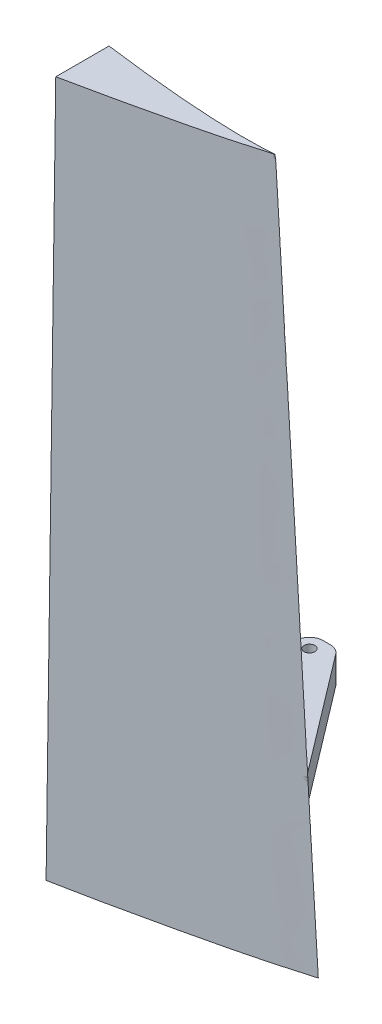
ISO-10303-21;
HEADER;
FILE_DESCRIPTION(('STEP AP214'),'2;1');
FILE_NAME('part.step','',(''),(''),'','','');
FILE_SCHEMA(('AUTOMOTIVE_DESIGN { 1 0 10303 214 1 1 1 1 }'));
ENDSEC;
DATA;
#1=APPLICATION_CONTEXT('core data for automotive mechanical design processes');
#2=APPLICATION_PROTOCOL_DEFINITION('international standard','automotive_design',2000,#1);
#3=PRODUCT_CONTEXT('',#1,'mechanical');
#4=PRODUCT('Part','Part','',(#3));
#5=PRODUCT_RELATED_PRODUCT_CATEGORY('part','',(#4));
#6=PRODUCT_DEFINITION_FORMATION('','',#4);
#7=PRODUCT_DEFINITION_CONTEXT('part definition',#1,'design');
#8=PRODUCT_DEFINITION('design','',#6,#7);
#9=PRODUCT_DEFINITION_SHAPE('','',#8);
#10=(LENGTH_UNIT() NAMED_UNIT(*) SI_UNIT(.MILLI.,.METRE.));
#11=(NAMED_UNIT(*) PLANE_ANGLE_UNIT() SI_UNIT($,.RADIAN.));
#12=(NAMED_UNIT(*) SI_UNIT($,.STERADIAN.) SOLID_ANGLE_UNIT());
#13=UNCERTAINTY_MEASURE_WITH_UNIT(LENGTH_MEASURE(1.E-05),#10,'distance_accuracy_value','');
#14=(GEOMETRIC_REPRESENTATION_CONTEXT(3) GLOBAL_UNCERTAINTY_ASSIGNED_CONTEXT((#13)) GLOBAL_UNIT_ASSIGNED_CONTEXT((#10,
#11,#12)) REPRESENTATION_CONTEXT('',''));
#15=CARTESIAN_POINT('',(0.,0.,0.));
#16=DIRECTION('',(0.,0.,1.));
#17=DIRECTION('',(1.,0.,0.));
#18=AXIS2_PLACEMENT_3D('',#15,#16,#17);
#19=CARTESIAN_POINT('',(0.,0.,-9.74075468761381));
#20=CARTESIAN_POINT('',(0.,100.,-9.10882338308395));
#21=CARTESIAN_POINT('',(6.0061327946258,0.,-8.91211822307364));
#22=CARTESIAN_POINT('',(4.83074507039604,100.,-8.48507393399278));
#23=CARTESIAN_POINT('',(13.4925178354512,0.,-7.96436008493839));
#24=CARTESIAN_POINT('',(10.8562340202713,99.9999999999999,-7.8023381409646));
#25=CARTESIAN_POINT('',(22.7343715259555,0.,-7.36164463409852));
#26=CARTESIAN_POINT('',(18.2837087437012,100.,-7.42026106854466));
#27=CARTESIAN_POINT('',(26.1484299527672,0.,-7.27193279379961));
#28=CARTESIAN_POINT('',(21.0283614825598,100.,-7.36259403798258));
#29=CARTESIAN_POINT('',(28.7053996672856,0.,-7.28866482606949));
#30=CARTESIAN_POINT('',(23.0823413646609,100.,-7.40087076527242));
#31=CARTESIAN_POINT('',(29.820959368834,0.,-7.31240387331745));
#32=CARTESIAN_POINT('',(23.9780975933803,100.,-7.43220381420277));
#33=CARTESIAN_POINT('',(30.7154561438188,0.,-7.36119318811639));
#34=CARTESIAN_POINT('',(24.6969922007095,100.,-7.46804709782093));
#35=CARTESIAN_POINT('',(31.0472754487582,0.,-7.37694125723781));
#36=CARTESIAN_POINT('',(24.9634580372859,100.,-7.48246091052375));
#37=CARTESIAN_POINT('',(31.1034867424999,0.,-7.37952788405883));
#38=CARTESIAN_POINT('',(25.0085685081877,100.,-7.48525379677008));
#39=CARTESIAN_POINT('',(31.3924160200126,0.,-7.39219815360227));
#40=CARTESIAN_POINT('',(25.240271714091,100.,-7.50132344338924));
#41=CARTESIAN_POINT('',(31.6228956510798,0.,-7.42006883497855));
#42=CARTESIAN_POINT('',(25.4264556624199,100.,-7.51998820533948));
#43=CARTESIAN_POINT('',(31.8753586265432,0.,-7.44723586825525));
#44=CARTESIAN_POINT('',(25.6232251348601,100.,-7.54451848316814));
#45=CARTESIAN_POINT('',(31.8915028454835,0.,-7.4489607280713));
#46=CARTESIAN_POINT('',(25.6425016889953,99.9999999999999,-7.54598208356528));
#47=CARTESIAN_POINT('',(31.9076853144743,0.,-7.45066994004273));
#48=CARTESIAN_POINT('',(25.6487450561573,100.,-7.54433163558381));
#49=CARTESIAN_POINT('',(31.9205102381514,0.,-7.45196702689124));
#50=CARTESIAN_POINT('',(25.6522646762437,100.,-7.54267559031721));
#51=CARTESIAN_POINT('',(31.9306592861827,0.,-7.45270429987545));
#52=CARTESIAN_POINT('',(25.6338782102697,100.,-7.53783962001277));
#53=CARTESIAN_POINT('',(31.9356214851594,0.,-7.45083311328495));
#54=CARTESIAN_POINT('',(25.62475437363,100.,-7.53598201101249));
#55=CARTESIAN_POINT('',(31.9359350866917,0.,-7.45068947570391));
#56=CARTESIAN_POINT('',(25.6241212292483,100.,-7.53585301240149));
#57=CARTESIAN_POINT('',(31.939430656982,0.,-7.44871947015887));
#58=CARTESIAN_POINT('',(25.6162419234391,100.,-7.53424653427601));
#59=CARTESIAN_POINT('',(31.9198546951872,0.,-7.44398246280323));
#60=CARTESIAN_POINT('',(25.6089983384478,100.,-7.53275781562939));
#61=CARTESIAN_POINT('',(31.6839387203871,0.,-7.39548664764486));
#62=CARTESIAN_POINT('',(25.4195218354743,100.,-7.49351391043845));
#63=CARTESIAN_POINT('',(31.4577328945988,0.,-7.34471355371303));
#64=CARTESIAN_POINT('',(25.2388903082908,100.,-7.44878342153052));
#65=CARTESIAN_POINT('',(31.2066353568834,0.,-7.27190684790176));
#66=CARTESIAN_POINT('',(25.0357141849858,100.,-7.39573470974058));
#67=CARTESIAN_POINT('',(30.3922993052073,0.,-7.0361349077299));
#68=CARTESIAN_POINT('',(24.3771398067983,100.,-7.22263958139223));
#69=CARTESIAN_POINT('',(29.5756562209111,0.,-6.80867925336944));
#70=CARTESIAN_POINT('',(23.7246463739093,100.,-7.02712253926371));
#71=CARTESIAN_POINT('',(28.6237362484546,0.,-6.52497274375956));
#72=CARTESIAN_POINT('',(22.9596749106355,100.,-6.79951717712916));
#73=CARTESIAN_POINT('',(26.0530539749238,0.,-5.76737991113132));
#74=CARTESIAN_POINT('',(20.8953524951071,99.9999999999998,-6.18624357400259));
#75=CARTESIAN_POINT('',(23.4505403594325,0.,-5.1243831208334));
#76=CARTESIAN_POINT('',(18.8130262924454,99.9999999999998,-5.63684193570972));
#77=CARTESIAN_POINT('',(20.832639059026,0.,-4.50201744049619));
#78=CARTESIAN_POINT('',(16.7115240068306,99.9999999999999,-5.13201881249129));
#79=CARTESIAN_POINT('',(16.3358571443051,0.,-3.43608040628613));
#80=CARTESIAN_POINT('',(13.1019899601075,99.9999999999999,-4.26628313216813));
#81=CARTESIAN_POINT('',(9.34362759695032,0.,-1.86555982861522));
#82=CARTESIAN_POINT('',(7.49088806589531,100.,-2.97315351682197));
#83=CARTESIAN_POINT('',(2.50228088319128,0.,-0.471593962152759));
#84=CARTESIAN_POINT('',(2.00418778404205,100.,-1.80976282935904));
#85=CARTESIAN_POINT('',(0.,0.,0.));
#86=CARTESIAN_POINT('',(0.,100.,-1.4));
#87=B_SPLINE_SURFACE_WITH_KNOTS('',3,1,((#19,#20),(#21,#22),(#23,#24),(#25,#26),(#27,#28),(#29,
#30),(#31,#32),(#33,#34),(#35,#36),(#37,#38),(#39,#40),(#41,#42),(#43,#44),(#45,#46),(#47,#48),
(#49,#50),(#51,#52),(#53,#54),(#55,#56),(#57,#58),(#59,#60),(#61,#62),(#63,#64),(#65,#66),(#67,
#68),(#69,#70),(#71,#72),(#73,#74),(#75,#76),(#77,#78),(#79,#80),(#81,#82),(#83,#84),(#85,#86)),
.UNSPECIFIED.,.F.,.F.,.F.,(4,1,1,1,1,1,2,2,2,1,2,2,2,2,2,1,2,1,2,1,1,4),(2,2),(0.,
0.280352533806822,0.34869858818309,0.428120218321933,0.438280244880666,0.466950155301034,
0.479707552212127,0.482309106800574,0.493077559149514,0.493720167324993,0.49380584417098,
0.494304555707245,0.494341745496035,0.49476738677823,0.505479493763305,0.506855620546668,
0.544678614705215,0.552784092814143,0.668603311183267,0.677186907922647,0.88225829703551,1.),
(0.,1.),.UNSPECIFIED.);
#88=CARTESIAN_POINT('',(0.,0.,0.));
#89=CARTESIAN_POINT('',(2.50228088319128,0.,-0.471593962152759));
#90=CARTESIAN_POINT('',(9.34362759695032,0.,-1.86555982861522));
#91=CARTESIAN_POINT('',(16.3358571443051,0.,-3.43608040628613));
#92=CARTESIAN_POINT('',(20.832639059026,0.,-4.50201744049619));
#93=CARTESIAN_POINT('',(23.4505403594325,0.,-5.1243831208334));
#94=CARTESIAN_POINT('',(26.0530539749238,0.,-5.76737991113132));
#95=CARTESIAN_POINT('',(28.6237362484546,0.,-6.52497274375956));
#96=CARTESIAN_POINT('',(29.5756562209111,0.,-6.80867925336944));
#97=CARTESIAN_POINT('',(30.3922993052073,0.,-7.0361349077299));
#98=CARTESIAN_POINT('',(31.2066353568834,0.,-7.27190684790176));
#99=CARTESIAN_POINT('',(31.4577328945988,0.,-7.34471355371303));
#100=CARTESIAN_POINT('',(31.6839387203871,0.,-7.39548664764486));
#101=CARTESIAN_POINT('',(31.9198546951872,0.,-7.44398246280323));
#102=CARTESIAN_POINT('',(31.939430656982,0.,-7.44871947015887));
#103=CARTESIAN_POINT('',(31.9359350866917,0.,-7.45068947570391));
#104=CARTESIAN_POINT('',(31.9356214851594,0.,-7.45083311328495));
#105=CARTESIAN_POINT('',(31.9306592861827,0.,-7.45270429987545));
#106=CARTESIAN_POINT('',(31.9205102381514,0.,-7.45196702689124));
#107=CARTESIAN_POINT('',(31.9076853144743,0.,-7.45066994004273));
#108=CARTESIAN_POINT('',(31.8915028454835,0.,-7.4489607280713));
#109=CARTESIAN_POINT('',(31.8753586265432,0.,-7.44723586825525));
#110=CARTESIAN_POINT('',(31.6228956510798,0.,-7.42006883497855));
#111=CARTESIAN_POINT('',(31.3924160200126,0.,-7.39219815360227));
#112=CARTESIAN_POINT('',(31.1034867424999,0.,-7.37952788405883));
#113=CARTESIAN_POINT('',(31.0472754487582,0.,-7.37694125723781));
#114=CARTESIAN_POINT('',(30.7154561438188,0.,-7.36119318811639));
#115=CARTESIAN_POINT('',(29.820959368834,0.,-7.31240387331745));
#116=CARTESIAN_POINT('',(28.7053996672856,0.,-7.28866482606949));
#117=CARTESIAN_POINT('',(26.1484299527672,0.,-7.27193279379961));
#118=CARTESIAN_POINT('',(22.7343715259555,0.,-7.36164463409852));
#119=CARTESIAN_POINT('',(13.4925178354512,0.,-7.96436008493839));
#120=CARTESIAN_POINT('',(6.0061327946258,0.,-8.91211822307364));
#121=CARTESIAN_POINT('',(0.,0.,-9.74075468761381));
#122=B_SPLINE_CURVE_WITH_KNOTS('',3,(#88,#89,#90,#91,#92,#93,#94,#95,#96,#97,#98,#99,#100,#101,
#102,#103,#104,#105,#106,#107,#108,#109,#110,#111,#112,#113,#114,#115,#116,#117,#118,#119,#120,
#121),.UNSPECIFIED.,.F.,.F.,(4,1,1,2,1,2,1,2,2,2,2,2,1,2,2,2,1,1,1,1,1,4),(0.,0.11774170296449,
0.322813092077353,0.331396688816733,0.447215907185857,0.455321385294785,0.493144379453332,
0.494520506236695,0.50523261322177,0.505658254503965,0.505695444292755,0.50619415582902,
0.506279832675007,0.506922440850486,0.517690893199426,0.520292447787873,0.533049844698966,
0.561719755119334,0.571879781678067,0.65130141181691,0.719647466193178,1.),.UNSPECIFIED.);
#123=CARTESIAN_POINT('',(0.,0.,-9.74075468761382));
#124=VERTEX_POINT('',#123);
#125=CARTESIAN_POINT('',(0.,0.,0.));
#126=VERTEX_POINT('',#125);
#127=EDGE_CURVE('E148',#124,#126,#122,.F.);
#128=CARTESIAN_POINT('',(0.,0.,-9.74075468761381));
#129=CARTESIAN_POINT('',(0.,100.,-9.10882338308395));
#130=B_SPLINE_CURVE_WITH_KNOTS('',1,(#128,#129),.UNSPECIFIED.,.F.,.F.,(2,2),(0.,1.),.UNSPECIFIED.);
#131=CARTESIAN_POINT('',(0.,100.,-9.10882338308395));
#132=VERTEX_POINT('',#131);
#133=EDGE_CURVE('E268',#124,#132,#130,.T.);
#134=CARTESIAN_POINT('',(0.,100.,-9.10882338308395));
#135=CARTESIAN_POINT('',(4.83074507039604,100.,-8.48507393399278));
#136=CARTESIAN_POINT('',(10.8562340202713,99.9999999999999,-7.8023381409646));
#137=CARTESIAN_POINT('',(18.2837087437012,100.,-7.42026106854466));
#138=CARTESIAN_POINT('',(21.0283614825598,100.,-7.36259403798258));
#139=CARTESIAN_POINT('',(23.0823413646609,100.,-7.40087076527242));
#140=CARTESIAN_POINT('',(23.9780975933803,100.,-7.43220381420277));
#141=CARTESIAN_POINT('',(24.6969922007095,100.,-7.46804709782093));
#142=CARTESIAN_POINT('',(24.9634580372859,100.,-7.48246091052375));
#143=CARTESIAN_POINT('',(25.0085685081877,100.,-7.48525379677008));
#144=CARTESIAN_POINT('',(25.240271714091,100.,-7.50132344338924));
#145=CARTESIAN_POINT('',(25.4264556624199,100.,-7.51998820533948));
#146=CARTESIAN_POINT('',(25.6232251348601,100.,-7.54451848316814));
#147=CARTESIAN_POINT('',(25.6425016889953,99.9999999999999,-7.54598208356528));
#148=CARTESIAN_POINT('',(25.6487450561573,100.,-7.54433163558381));
#149=CARTESIAN_POINT('',(25.6522646762437,100.,-7.54267559031721));
#150=CARTESIAN_POINT('',(25.6338782102697,100.,-7.53783962001277));
#151=CARTESIAN_POINT('',(25.62475437363,100.,-7.53598201101249));
#152=CARTESIAN_POINT('',(25.6241212292483,100.,-7.53585301240149));
#153=CARTESIAN_POINT('',(25.6162419234391,100.,-7.53424653427601));
#154=CARTESIAN_POINT('',(25.6089983384478,100.,-7.53275781562939));
#155=CARTESIAN_POINT('',(25.4195218354743,100.,-7.49351391043845));
#156=CARTESIAN_POINT('',(25.2388903082908,100.,-7.44878342153052));
#157=CARTESIAN_POINT('',(25.0357141849858,100.,-7.39573470974058));
#158=CARTESIAN_POINT('',(24.3771398067983,100.,-7.22263958139223));
#159=CARTESIAN_POINT('',(23.7246463739093,100.,-7.02712253926371));
#160=CARTESIAN_POINT('',(22.9596749106355,100.,-6.79951717712916));
#161=CARTESIAN_POINT('',(20.8953524951071,99.9999999999998,-6.18624357400259));
#162=CARTESIAN_POINT('',(18.8130262924454,99.9999999999998,-5.63684193570972));
#163=CARTESIAN_POINT('',(16.7115240068306,99.9999999999999,-5.13201881249129));
#164=CARTESIAN_POINT('',(13.1019899601075,99.9999999999999,-4.26628313216813));
#165=CARTESIAN_POINT('',(7.49088806589531,100.,-2.97315351682197));
#166=CARTESIAN_POINT('',(2.00418778404205,100.,-1.80976282935904));
#167=CARTESIAN_POINT('',(0.,100.,-1.4));
#168=B_SPLINE_CURVE_WITH_KNOTS('',3,(#134,#135,#136,#137,#138,#139,#140,#141,#142,#143,#144,
#145,#146,#147,#148,#149,#150,#151,#152,#153,#154,#155,#156,#157,#158,#159,#160,#161,#162,#163,
#164,#165,#166,#167),.UNSPECIFIED.,.F.,.F.,(4,1,1,1,1,1,2,2,2,1,2,2,2,2,2,1,2,1,2,1,1,4),(0.,
0.280352533806822,0.34869858818309,0.428120218321933,0.438280244880666,0.466950155301034,
0.479707552212127,0.482309106800574,0.493077559149514,0.493720167324993,0.49380584417098,
0.494304555707245,0.494341745496035,0.49476738677823,0.505479493763305,0.506855620546668,
0.544678614705215,0.552784092814143,0.668603311183267,0.677186907922647,0.88225829703551,1.),.UNSPECIFIED.);
#169=CARTESIAN_POINT('',(0.,100.,-1.4));
#170=VERTEX_POINT('',#169);
#171=EDGE_CURVE('E152',#170,#132,#168,.F.);
#172=CARTESIAN_POINT('',(0.,100.,-1.4));
#173=CARTESIAN_POINT('',(0.,0.,0.));
#174=B_SPLINE_CURVE_WITH_KNOTS('',1,(#172,#173),.UNSPECIFIED.,.F.,.F.,(2,2),(0.,1.),.UNSPECIFIED.);
#175=EDGE_CURVE('E283',#126,#170,#174,.F.);
#176=CARTESIAN_POINT('',(27.6577912531365,6.,-7.29053907199752));
#177=CARTESIAN_POINT('',(26.88755452627,6.,-7.28490868604674));
#178=CARTESIAN_POINT('',(26.1173154660965,6.,-7.28976908745462));
#179=CARTESIAN_POINT('',(24.5775002676797,6.,-7.3176622509968));
#180=CARTESIAN_POINT('',(23.8079239870242,6.,-7.34068687988562));
#181=CARTESIAN_POINT('',(22.26948033135,6.,-7.40209653629572));
#182=CARTESIAN_POINT('',(21.5006128994215,6.,-7.44048019889503));
#183=CARTESIAN_POINT('',(19.964402855378,6.,-7.52996945690902));
#184=CARTESIAN_POINT('',(19.1970594873694,6.,-7.5810622442991));
#185=CARTESIAN_POINT('',(18.0465760351733,6.,-7.66536187728852));
#186=CARTESIAN_POINT('',(17.6631483228459,6.,-7.69474038884396));
#187=CARTESIAN_POINT('',(16.8964784944677,6.,-7.75582860834423));
#188=CARTESIAN_POINT('',(16.5132363782466,6.,-7.78753831414491));
#189=CARTESIAN_POINT('',(15.3637759782826,6.,-7.88601592653525));
#190=CARTESIAN_POINT('',(14.5978433741245,6.,-7.95613086896472));
#191=CARTESIAN_POINT('',(12.7535137668412,6.,-8.13463059994562));
#192=CARTESIAN_POINT('',(11.6754971286222,6.,-8.246935677293));
#193=CARTESIAN_POINT('',(9.52097112954043,6.,-8.48466798200871));
#194=CARTESIAN_POINT('',(8.44446170699565,6.,-8.61009465547136));
#195=CARTESIAN_POINT('',(6.29252012915158,6.,-8.87143539953864));
#196=CARTESIAN_POINT('',(5.217088213312,6.,-9.00735142948402));
#197=CARTESIAN_POINT('',(3.06723698073207,6.,-9.28700223550382));
#198=CARTESIAN_POINT('',(1.99281767433479,6.,-9.43073709057992));
#199=CARTESIAN_POINT('',(0.612474602769467,6.,-9.61878666277008));
#200=CARTESIAN_POINT('',(0.306224683956877,6.,-9.66072276623258));
#201=CARTESIAN_POINT('',(0.,6.,-9.70283880934202));
#202=B_SPLINE_CURVE_WITH_KNOTS('',3,(#176,#177,#178,#179,#180,#181,#182,#183,#184,#185,#186,
#187,#188,#189,#190,#191,#192,#193,#194,#195,#196,#197,#198,#199,#200,#201),.UNSPECIFIED.,.F.,
.F.,(4,2,2,2,2,2,2,2,2,2,2,2,4),(0.,2.31059328374136,4.62015255909725,6.92950663480297,
9.2365427482386,10.3901922562655,11.5438407032183,13.8511969474663,17.1026462061816,
20.353958265887,23.6058791254978,26.8578328487349,27.7851557834207),.UNSPECIFIED.);
#203=CARTESIAN_POINT('',(26.9237939059362,6.,-7.28830980668479));
#204=VERTEX_POINT('',#203);
#205=CARTESIAN_POINT('',(2.00000000000006,6.,-9.43070005869538));
#206=VERTEX_POINT('',#205);
#207=EDGE_CURVE('E145',#204,#206,#202,.T.);
#208=CARTESIAN_POINT('',(26.9206990523633,10.,-7.29238412125393));
#209=CARTESIAN_POINT('',(26.9212565699026,9.33333342153255,-7.29165016025084));
#210=CARTESIAN_POINT('',(26.9217932331366,8.66666679896548,-7.2909436535352));
#211=CARTESIAN_POINT('',(26.9228248509943,7.33333346563215,-7.28958554867882));
#212=CARTESIAN_POINT('',(26.9233198056179,6.66666675486588,-7.28893395053808));
#213=CARTESIAN_POINT('',(26.9237939059362,6.,-7.28830980668479));
#214=B_SPLINE_CURVE_WITH_KNOTS('',3,(#208,#209,#210,#211,#212,#213),.UNSPECIFIED.,.F.,.F.,(4,2,
4),(0.,2.00000163880864,4.00000327761728),.UNSPECIFIED.);
#215=CARTESIAN_POINT('',(26.9206990523633,10.,-7.29238412125393));
#216=VERTEX_POINT('',#215);
#217=EDGE_CURVE('E125',#216,#204,#214,.T.);
#218=CARTESIAN_POINT('',(27.6577912531365,10.,-7.29675715590079));
#219=CARTESIAN_POINT('',(26.8876816320744,10.,-7.28878561864999));
#220=CARTESIAN_POINT('',(26.1175426648211,10.,-7.2916054783968));
#221=CARTESIAN_POINT('',(24.5779069277351,10.,-7.31585760928194));
#222=CARTESIAN_POINT('',(23.8084100260824,10.,-7.3372811575338));
#223=CARTESIAN_POINT('',(22.2701080186106,10.,-7.39576566655825));
#224=CARTESIAN_POINT('',(21.5013028553963,10.,-7.4328251810249));
#225=CARTESIAN_POINT('',(20.3490585117972,10.,-7.49809446640828));
#226=CARTESIAN_POINT('',(19.9653355803055,10.,-7.52144967244734));
#227=CARTESIAN_POINT('',(19.1980785539258,10.,-7.57109402453383));
#228=CARTESIAN_POINT('',(18.814544459275,10.,-7.59738317425626));
#229=CARTESIAN_POINT('',(18.0476222524924,10.,-7.65256974385793));
#230=CARTESIAN_POINT('',(17.6642341612302,10.,-7.68146745225655));
#231=CARTESIAN_POINT('',(16.8976444742128,10.,-7.74162857763506));
#232=CARTESIAN_POINT('',(16.5144428783078,10.,-7.77289199271294));
#233=CARTESIAN_POINT('',(15.3651030513193,10.,-7.87007871338924));
#234=CARTESIAN_POINT('',(14.5992505106,10.,-7.93939698797456));
#235=CARTESIAN_POINT('',(12.7534661888545,10.,-8.11627671264268));
#236=CARTESIAN_POINT('',(11.6739190167467,10.,-8.22784069910487));
#237=CARTESIAN_POINT('',(9.5163506553495,10.,-8.46432661882422));
#238=CARTESIAN_POINT('',(8.43832940090011,10.,-8.58924796311823));
#239=CARTESIAN_POINT('',(6.283374362642,10.,-8.84977003836634));
#240=CARTESIAN_POINT('',(5.20644083023436,10.,-8.98537283542685));
#241=CARTESIAN_POINT('',(3.05360203291564,10.,-9.26454415844636));
#242=CARTESIAN_POINT('',(1.97769677891483,10.,-9.40811276799067));
#243=CARTESIAN_POINT('',(0.601408164361189,10.,-9.59520515005319));
#244=CARTESIAN_POINT('',(0.300691686479938,10.,-9.63629478806386));
#245=CARTESIAN_POINT('',(0.,10.,-9.67756155716083));
#246=B_SPLINE_CURVE_WITH_KNOTS('',3,(#218,#219,#220,#221,#222,#223,#224,#225,#226,#227,#228,
#229,#230,#231,#232,#233,#234,#235,#236,#237,#238,#239,#240,#241,#242,#243,#244,#245),
.UNSPECIFIED.,.F.,.F.,(4,2,2,2,2,2,2,2,2,2,2,2,2,4),(0.,2.31025741364136,4.61943217968396,
6.92839339696412,8.08168324150637,9.23497453065529,10.3883935361389,11.5418116142943,
13.8487101193214,17.1044936300783,20.3601336434156,23.6164049468034,26.8727104247258,
27.7832420521575),.UNSPECIFIED.);
#247=CARTESIAN_POINT('',(2.00000000000006,10.,-9.40606849937484));
#248=VERTEX_POINT('',#247);
#249=EDGE_CURVE('E135',#216,#248,#246,.T.);
#250=CARTESIAN_POINT('',(2.00000000000006,6.,-9.43070005869538));
#251=CARTESIAN_POINT('',(2.00000000000006,7.33333333333333,-9.42248953892187));
#252=CARTESIAN_POINT('',(2.00000000000006,8.66666666666667,-9.41427901914835));
#253=CARTESIAN_POINT('',(2.00000000000006,10.,-9.40606849937484));
#254=B_SPLINE_CURVE_WITH_KNOTS('',3,(#250,#251,#252,#253),.UNSPECIFIED.,.F.,.F.,(4,4),(0.,
4.00007583849539),.UNSPECIFIED.);
#255=EDGE_CURVE('E144',#206,#248,#254,.T.);
#256=ORIENTED_EDGE('',*,*,#127,.F.);
#257=ORIENTED_EDGE('',*,*,#133,.T.);
#258=ORIENTED_EDGE('',*,*,#171,.F.);
#259=ORIENTED_EDGE('',*,*,#175,.F.);
#260=EDGE_LOOP('',(#256,#257,#258,#259));
#261=FACE_BOUND('',#260,.T.);
#262=ORIENTED_EDGE('',*,*,#207,.F.);
#263=ORIENTED_EDGE('',*,*,#217,.F.);
#264=ORIENTED_EDGE('',*,*,#249,.T.);
#265=ORIENTED_EDGE('',*,*,#255,.F.);
#266=EDGE_LOOP('',(#262,#263,#264,#265));
#267=FACE_BOUND('',#266,.T.);
#268=ADVANCED_FACE('F35',(#261,#267),#87,.F.);
#269=CARTESIAN_POINT('',(25.3066700566454,100.,-7.46686878639095));
#270=DIRECTION('',(0.,1.,0.));
#271=DIRECTION('',(0.,0.,-1.));
#272=AXIS2_PLACEMENT_3D('',#269,#270,#271);
#273=PLANE('',#272);
#274=ORIENTED_EDGE('',*,*,#171,.T.);
#275=CARTESIAN_POINT('',(0.,100.,-1.4));
#276=DIRECTION('',(0.,0.,-1.));
#277=VECTOR('',#276,1.);
#278=LINE('',#275,#277);
#279=EDGE_CURVE('E414',#170,#132,#278,.T.);
#280=ORIENTED_EDGE('',*,*,#279,.F.);
#281=EDGE_LOOP('',(#274,#280));
#282=FACE_BOUND('',#281,.T.);
#283=ADVANCED_FACE('F177',(#282),#273,.T.);
#284=CARTESIAN_POINT('',(31.5444630062648,0.,-7.36200861283949));
#285=DIRECTION('',(0.,1.,0.));
#286=DIRECTION('',(0.,0.,-1.));
#287=AXIS2_PLACEMENT_3D('',#284,#285,#286);
#288=PLANE('',#287);
#289=ORIENTED_EDGE('',*,*,#127,.T.);
#290=CARTESIAN_POINT('',(0.,0.,0.));
#291=DIRECTION('',(0.,0.,-1.));
#292=VECTOR('',#291,1.);
#293=LINE('',#290,#292);
#294=EDGE_CURVE('E285',#126,#124,#293,.T.);
#295=ORIENTED_EDGE('',*,*,#294,.T.);
#296=EDGE_LOOP('',(#289,#295));
#297=FACE_BOUND('',#296,.T.);
#298=ADVANCED_FACE('F182',(#297),#288,.F.);
#299=CARTESIAN_POINT('',(0.,0.,0.));
#300=DIRECTION('',(1.,0.,0.));
#301=DIRECTION('',(0.,0.,1.));
#302=AXIS2_PLACEMENT_3D('',#299,#300,#301);
#303=PLANE('',#302);
#304=ORIENTED_EDGE('',*,*,#133,.F.);
#305=ORIENTED_EDGE('',*,*,#294,.F.);
#306=ORIENTED_EDGE('',*,*,#175,.T.);
#307=ORIENTED_EDGE('',*,*,#279,.T.);
#308=EDGE_LOOP('',(#304,#305,#306,#307));
#309=FACE_BOUND('',#308,.T.);
#310=ADVANCED_FACE('F179',(#309),#303,.F.);
#311=CARTESIAN_POINT('',(0.,10.,0.));
#312=DIRECTION('',(0.,1.,0.));
#313=DIRECTION('',(0.,0.,-1.));
#314=AXIS2_PLACEMENT_3D('',#311,#312,#313);
#315=PLANE('',#314);
#316=CARTESIAN_POINT('',(0.,10.,-38.1));
#317=DIRECTION('',(0.,-1.,0.));
#318=DIRECTION('',(0.,0.,-1.));
#319=AXIS2_PLACEMENT_3D('',#316,#317,#318);
#320=CIRCLE('',#319,0.787399999999994);
#321=CARTESIAN_POINT('',(0.,10.,-38.8874));
#322=VERTEX_POINT('',#321);
#323=EDGE_CURVE('E257',#322,#322,#320,.T.);
#324=ORIENTED_EDGE('',*,*,#323,.T.);
#325=EDGE_LOOP('',(#324));
#326=FACE_BOUND('',#325,.T.);
#327=DIRECTION('',(1.,0.,0.));
#328=VECTOR('',#327,1.);
#329=CARTESIAN_POINT('',(2.,10.,-40.1));
#330=LINE('',#329,#328);
#331=CARTESIAN_POINT('',(0.,10.,-40.1));
#332=VERTEX_POINT('',#331);
#333=CARTESIAN_POINT('',(1.00763385065583,10.,-40.1));
#334=VERTEX_POINT('',#333);
#335=EDGE_CURVE('E265',#332,#334,#330,.T.);
#336=ORIENTED_EDGE('',*,*,#335,.F.);
#337=CARTESIAN_POINT('',(0.,10.,-38.1));
#338=DIRECTION('',(0.,-1.,0.));
#339=DIRECTION('',(0.,0.,-1.));
#340=AXIS2_PLACEMENT_3D('',#337,#338,#339);
#341=CIRCLE('',#340,2.);
#342=CARTESIAN_POINT('',(-2.,10.,-38.1));
#343=VERTEX_POINT('',#342);
#344=EDGE_CURVE('E329',#343,#332,#341,.T.);
#345=ORIENTED_EDGE('',*,*,#344,.F.);
#346=DIRECTION('',(0.,0.,-1.));
#347=VECTOR('',#346,1.);
#348=CARTESIAN_POINT('',(-2.,10.,-40.1));
#349=LINE('',#348,#347);
#350=CARTESIAN_POINT('',(-2.,10.,-25.4));
#351=VERTEX_POINT('',#350);
#352=EDGE_CURVE('E263',#351,#343,#349,.T.);
#353=ORIENTED_EDGE('',*,*,#352,.F.);
#354=CARTESIAN_POINT('',(0.,10.,-25.4));
#355=DIRECTION('',(0.,-1.,0.));
#356=DIRECTION('',(0.,0.,-1.));
#357=AXIS2_PLACEMENT_3D('',#354,#355,#356);
#358=CIRCLE('',#357,2.);
#359=CARTESIAN_POINT('',(0.,10.,-23.4));
#360=VERTEX_POINT('',#359);
#361=EDGE_CURVE('E326',#360,#351,#358,.T.);
#362=ORIENTED_EDGE('',*,*,#361,.F.);
#363=CARTESIAN_POINT('',(0.,10.,-21.4));
#364=DIRECTION('',(0.,-1.,0.));
#365=DIRECTION('',(0.,0.,-1.));
#366=AXIS2_PLACEMENT_3D('',#363,#364,#365);
#367=CIRCLE('',#366,2.);
#368=CARTESIAN_POINT('',(2.00000000000028,10.,-21.4));
#369=VERTEX_POINT('',#368);
#370=EDGE_CURVE('E11',#369,#360,#367,.F.);
#371=ORIENTED_EDGE('',*,*,#370,.F.);
#372=DIRECTION('',(0.,0.,-1.));
#373=VECTOR('',#372,1.);
#374=CARTESIAN_POINT('',(2.,10.,-6.55488280363372));
#375=LINE('',#374,#373);
#376=EDGE_CURVE('E131',#248,#369,#375,.T.);
#377=ORIENTED_EDGE('',*,*,#376,.F.);
#378=ORIENTED_EDGE('',*,*,#249,.F.);
#379=DIRECTION('',(0.604881866279893,0.,0.796315218896232));
#380=VECTOR('',#379,1.);
#381=CARTESIAN_POINT('',(26.9275230788702,10.,-7.28340042300719));
#382=LINE('',#381,#380);
#383=CARTESIAN_POINT('',(2.60026428844832,10.,-39.3097637325598));
#384=VERTEX_POINT('',#383);
#385=EDGE_CURVE('E120',#384,#216,#382,.T.);
#386=ORIENTED_EDGE('',*,*,#385,.F.);
#387=CARTESIAN_POINT('',(1.00763385065583,10.,-38.1));
#388=DIRECTION('',(0.,-1.,0.));
#389=DIRECTION('',(0.,0.,-1.));
#390=AXIS2_PLACEMENT_3D('',#387,#388,#389);
#391=CIRCLE('',#390,2.);
#392=EDGE_CURVE('E352',#334,#384,#391,.T.);
#393=ORIENTED_EDGE('',*,*,#392,.F.);
#394=EDGE_LOOP('',(#336,#345,#353,#362,#371,#377,#378,#386,#393));
#395=FACE_BOUND('',#394,.T.);
#396=CARTESIAN_POINT('',(0.,10.,-25.4));
#397=DIRECTION('',(0.,-1.,0.));
#398=DIRECTION('',(0.,0.,-1.));
#399=AXIS2_PLACEMENT_3D('',#396,#397,#398);
#400=CIRCLE('',#399,0.787399999999994);
#401=CARTESIAN_POINT('',(0.,10.,-26.1874));
#402=VERTEX_POINT('',#401);
#403=EDGE_CURVE('E252',#402,#402,#400,.T.);
#404=ORIENTED_EDGE('',*,*,#403,.T.);
#405=EDGE_LOOP('',(#404));
#406=FACE_BOUND('',#405,.T.);
#407=ADVANCED_FACE('F137',(#326,#395,#406),#315,.T.);
#408=CARTESIAN_POINT('',(0.,6.,0.));
#409=DIRECTION('',(0.,1.,0.));
#410=DIRECTION('',(0.,0.,-1.));
#411=AXIS2_PLACEMENT_3D('',#408,#409,#410);
#412=PLANE('',#411);
#413=DIRECTION('',(0.604881866279893,0.,0.796315218896232));
#414=VECTOR('',#413,1.);
#415=CARTESIAN_POINT('',(26.9275230788702,6.,-7.28340042300719));
#416=LINE('',#415,#414);
#417=CARTESIAN_POINT('',(2.6002642884483,6.,-39.3097637325598));
#418=VERTEX_POINT('',#417);
#419=EDGE_CURVE('E132',#418,#204,#416,.T.);
#420=ORIENTED_EDGE('',*,*,#419,.T.);
#421=ORIENTED_EDGE('',*,*,#207,.T.);
#422=DIRECTION('',(0.,0.,-1.));
#423=VECTOR('',#422,1.);
#424=CARTESIAN_POINT('',(2.,6.,-23.4));
#425=LINE('',#424,#423);
#426=CARTESIAN_POINT('',(2.00000000000001,6.,-21.4));
#427=VERTEX_POINT('',#426);
#428=EDGE_CURVE('E260',#206,#427,#425,.T.);
#429=ORIENTED_EDGE('',*,*,#428,.T.);
#430=CARTESIAN_POINT('',(0.,6.,-21.4));
#431=DIRECTION('',(0.,-1.,0.));
#432=DIRECTION('',(0.,0.,-1.));
#433=AXIS2_PLACEMENT_3D('',#430,#431,#432);
#434=CIRCLE('',#433,2.);
#435=CARTESIAN_POINT('',(0.,6.,-23.4));
#436=VERTEX_POINT('',#435);
#437=EDGE_CURVE('E44',#436,#427,#434,.T.);
#438=ORIENTED_EDGE('',*,*,#437,.F.);
#439=CARTESIAN_POINT('',(0.,6.,-25.4));
#440=DIRECTION('',(0.,-1.,0.));
#441=DIRECTION('',(0.,0.,-1.));
#442=AXIS2_PLACEMENT_3D('',#439,#440,#441);
#443=CIRCLE('',#442,2.);
#444=CARTESIAN_POINT('',(-2.,6.,-25.4));
#445=VERTEX_POINT('',#444);
#446=EDGE_CURVE('E341',#445,#436,#443,.F.);
#447=ORIENTED_EDGE('',*,*,#446,.F.);
#448=DIRECTION('',(0.,0.,-1.));
#449=VECTOR('',#448,1.);
#450=CARTESIAN_POINT('',(-2.,6.,-40.1));
#451=LINE('',#450,#449);
#452=CARTESIAN_POINT('',(-2.,6.,-38.1));
#453=VERTEX_POINT('',#452);
#454=EDGE_CURVE('E271',#445,#453,#451,.T.);
#455=ORIENTED_EDGE('',*,*,#454,.T.);
#456=CARTESIAN_POINT('',(0.,6.,-38.1));
#457=DIRECTION('',(0.,-1.,0.));
#458=DIRECTION('',(0.,0.,-1.));
#459=AXIS2_PLACEMENT_3D('',#456,#457,#458);
#460=CIRCLE('',#459,2.);
#461=CARTESIAN_POINT('',(0.,6.,-40.1));
#462=VERTEX_POINT('',#461);
#463=EDGE_CURVE('E337',#462,#453,#460,.F.);
#464=ORIENTED_EDGE('',*,*,#463,.F.);
#465=DIRECTION('',(1.,0.,0.));
#466=VECTOR('',#465,1.);
#467=CARTESIAN_POINT('',(2.,6.,-40.1));
#468=LINE('',#467,#466);
#469=CARTESIAN_POINT('',(1.00763385065583,6.,-40.1));
#470=VERTEX_POINT('',#469);
#471=EDGE_CURVE('E274',#462,#470,#468,.T.);
#472=ORIENTED_EDGE('',*,*,#471,.T.);
#473=CARTESIAN_POINT('',(1.00763385065583,6.,-38.1));
#474=DIRECTION('',(0.,-1.,0.));
#475=DIRECTION('',(0.,0.,-1.));
#476=AXIS2_PLACEMENT_3D('',#473,#474,#475);
#477=CIRCLE('',#476,2.);
#478=EDGE_CURVE('E340',#418,#470,#477,.F.);
#479=ORIENTED_EDGE('',*,*,#478,.F.);
#480=EDGE_LOOP('',(#420,#421,#429,#438,#447,#455,#464,#472,#479));
#481=FACE_BOUND('',#480,.T.);
#482=CARTESIAN_POINT('',(0.,6.,-38.1));
#483=DIRECTION('',(0.,-1.,0.));
#484=DIRECTION('',(0.,0.,-1.));
#485=AXIS2_PLACEMENT_3D('',#482,#483,#484);
#486=CIRCLE('',#485,0.787399999999994);
#487=CARTESIAN_POINT('',(0.,6.,-38.8874));
#488=VERTEX_POINT('',#487);
#489=EDGE_CURVE('E247',#488,#488,#486,.T.);
#490=ORIENTED_EDGE('',*,*,#489,.F.);
#491=EDGE_LOOP('',(#490));
#492=FACE_BOUND('',#491,.T.);
#493=CARTESIAN_POINT('',(0.,6.,-25.4));
#494=DIRECTION('',(0.,-1.,0.));
#495=DIRECTION('',(0.,0.,-1.));
#496=AXIS2_PLACEMENT_3D('',#493,#494,#495);
#497=CIRCLE('',#496,0.787399999999994);
#498=CARTESIAN_POINT('',(0.,6.,-26.1874));
#499=VERTEX_POINT('',#498);
#500=EDGE_CURVE('E250',#499,#499,#497,.T.);
#501=ORIENTED_EDGE('',*,*,#500,.F.);
#502=EDGE_LOOP('',(#501));
#503=FACE_BOUND('',#502,.T.);
#504=ADVANCED_FACE('F229',(#481,#492,#503),#412,.F.);
#505=CARTESIAN_POINT('',(2.,10.,-23.4));
#506=DIRECTION('',(1.,0.,0.));
#507=DIRECTION('',(0.,0.,1.));
#508=AXIS2_PLACEMENT_3D('',#505,#506,#507);
#509=PLANE('',#508);
#510=ORIENTED_EDGE('',*,*,#428,.F.);
#511=ORIENTED_EDGE('',*,*,#255,.T.);
#512=ORIENTED_EDGE('',*,*,#376,.T.);
#513=DIRECTION('',(0.,-1.,0.));
#514=VECTOR('',#513,1.);
#515=CARTESIAN_POINT('',(2.00000000000001,10.,-21.4));
#516=LINE('',#515,#514);
#517=EDGE_CURVE('E334',#427,#369,#516,.F.);
#518=ORIENTED_EDGE('',*,*,#517,.F.);
#519=EDGE_LOOP('',(#510,#511,#512,#518));
#520=FACE_BOUND('',#519,.T.);
#521=ADVANCED_FACE('F235',(#520),#509,.F.);
#522=CARTESIAN_POINT('',(-2.,10.,-40.1));
#523=DIRECTION('',(1.,0.,0.));
#524=DIRECTION('',(0.,0.,1.));
#525=AXIS2_PLACEMENT_3D('',#522,#523,#524);
#526=PLANE('',#525);
#527=ORIENTED_EDGE('',*,*,#454,.F.);
#528=DIRECTION('',(0.,-1.,0.));
#529=VECTOR('',#528,1.);
#530=CARTESIAN_POINT('',(-2.,10.,-25.4));
#531=LINE('',#530,#529);
#532=EDGE_CURVE('E58',#351,#445,#531,.T.);
#533=ORIENTED_EDGE('',*,*,#532,.F.);
#534=ORIENTED_EDGE('',*,*,#352,.T.);
#535=DIRECTION('',(0.,-1.,0.));
#536=VECTOR('',#535,1.);
#537=CARTESIAN_POINT('',(-2.,10.,-38.1));
#538=LINE('',#537,#536);
#539=EDGE_CURVE('E51',#453,#343,#538,.F.);
#540=ORIENTED_EDGE('',*,*,#539,.F.);
#541=EDGE_LOOP('',(#527,#533,#534,#540));
#542=FACE_BOUND('',#541,.T.);
#543=ADVANCED_FACE('F240',(#542),#526,.F.);
#544=CARTESIAN_POINT('',(2.,10.,-40.1));
#545=DIRECTION('',(0.,0.,1.));
#546=DIRECTION('',(-1.,0.,0.));
#547=AXIS2_PLACEMENT_3D('',#544,#545,#546);
#548=PLANE('',#547);
#549=ORIENTED_EDGE('',*,*,#471,.F.);
#550=DIRECTION('',(0.,-1.,0.));
#551=VECTOR('',#550,1.);
#552=CARTESIAN_POINT('',(0.,10.,-40.1));
#553=LINE('',#552,#551);
#554=EDGE_CURVE('E338',#332,#462,#553,.T.);
#555=ORIENTED_EDGE('',*,*,#554,.F.);
#556=ORIENTED_EDGE('',*,*,#335,.T.);
#557=DIRECTION('',(0.,-1.,0.));
#558=VECTOR('',#557,1.);
#559=CARTESIAN_POINT('',(1.00763385065583,10.,-40.1));
#560=LINE('',#559,#558);
#561=EDGE_CURVE('E330',#470,#334,#560,.F.);
#562=ORIENTED_EDGE('',*,*,#561,.F.);
#563=EDGE_LOOP('',(#549,#555,#556,#562));
#564=FACE_BOUND('',#563,.T.);
#565=ADVANCED_FACE('F357',(#564),#548,.F.);
#566=CARTESIAN_POINT('',(26.9275230788702,10.,-7.28340042300719));
#567=DIRECTION('',(-0.796315218896232,0.,0.604881866279893));
#568=DIRECTION('',(-0.604881866279893,0.,-0.796315218896232));
#569=AXIS2_PLACEMENT_3D('',#566,#567,#568);
#570=PLANE('',#569);
#571=ORIENTED_EDGE('',*,*,#385,.T.);
#572=ORIENTED_EDGE('',*,*,#217,.T.);
#573=ORIENTED_EDGE('',*,*,#419,.F.);
#574=DIRECTION('',(0.,-1.,0.));
#575=VECTOR('',#574,1.);
#576=CARTESIAN_POINT('',(2.6002642884483,10.,-39.3097637325598));
#577=LINE('',#576,#575);
#578=EDGE_CURVE('E127',#384,#418,#577,.T.);
#579=ORIENTED_EDGE('',*,*,#578,.F.);
#580=EDGE_LOOP('',(#571,#572,#573,#579));
#581=FACE_BOUND('',#580,.T.);
#582=ADVANCED_FACE('F122',(#581),#570,.F.);
#583=CARTESIAN_POINT('',(0.,10.,-38.1));
#584=DIRECTION('',(0.,-1.,0.));
#585=DIRECTION('',(0.,0.,1.));
#586=AXIS2_PLACEMENT_3D('',#583,#584,#585);
#587=CYLINDRICAL_SURFACE('',#586,0.787399999999994);
#588=ORIENTED_EDGE('',*,*,#323,.F.);
#589=EDGE_LOOP('',(#588));
#590=FACE_BOUND('',#589,.T.);
#591=ORIENTED_EDGE('',*,*,#489,.T.);
#592=EDGE_LOOP('',(#591));
#593=FACE_BOUND('',#592,.T.);
#594=ADVANCED_FACE('F231',(#590,#593),#587,.F.);
#595=CARTESIAN_POINT('',(0.,10.,-25.4));
#596=DIRECTION('',(0.,-1.,0.));
#597=DIRECTION('',(0.,0.,1.));
#598=AXIS2_PLACEMENT_3D('',#595,#596,#597);
#599=CYLINDRICAL_SURFACE('',#598,0.787399999999994);
#600=ORIENTED_EDGE('',*,*,#403,.F.);
#601=EDGE_LOOP('',(#600));
#602=FACE_BOUND('',#601,.T.);
#603=ORIENTED_EDGE('',*,*,#500,.T.);
#604=EDGE_LOOP('',(#603));
#605=FACE_BOUND('',#604,.T.);
#606=ADVANCED_FACE('F315',(#602,#605),#599,.F.);
#607=CARTESIAN_POINT('',(1.00763385065583,10.,-38.1));
#608=DIRECTION('',(0.,-1.,0.));
#609=DIRECTION('',(0.,0.,1.));
#610=AXIS2_PLACEMENT_3D('',#607,#608,#609);
#611=CYLINDRICAL_SURFACE('',#610,2.);
#612=ORIENTED_EDGE('',*,*,#392,.T.);
#613=ORIENTED_EDGE('',*,*,#578,.T.);
#614=ORIENTED_EDGE('',*,*,#478,.T.);
#615=ORIENTED_EDGE('',*,*,#561,.T.);
#616=EDGE_LOOP('',(#612,#613,#614,#615));
#617=FACE_BOUND('',#616,.T.);
#618=ADVANCED_FACE('F310',(#617),#611,.T.);
#619=CARTESIAN_POINT('',(0.,10.,-38.1));
#620=DIRECTION('',(0.,-1.,0.));
#621=DIRECTION('',(0.,0.,1.));
#622=AXIS2_PLACEMENT_3D('',#619,#620,#621);
#623=CYLINDRICAL_SURFACE('',#622,2.);
#624=ORIENTED_EDGE('',*,*,#344,.T.);
#625=ORIENTED_EDGE('',*,*,#554,.T.);
#626=ORIENTED_EDGE('',*,*,#463,.T.);
#627=ORIENTED_EDGE('',*,*,#539,.T.);
#628=EDGE_LOOP('',(#624,#625,#626,#627));
#629=FACE_BOUND('',#628,.T.);
#630=ADVANCED_FACE('F314',(#629),#623,.T.);
#631=CARTESIAN_POINT('',(0.,10.,-21.4));
#632=DIRECTION('',(0.,1.,0.));
#633=DIRECTION('',(0.,0.,-1.));
#634=AXIS2_PLACEMENT_3D('',#631,#632,#633);
#635=CYLINDRICAL_SURFACE('',#634,2.);
#636=DIRECTION('',(0.,-1.,0.));
#637=VECTOR('',#636,1.);
#638=CARTESIAN_POINT('',(0.,6.,-23.4));
#639=LINE('',#638,#637);
#640=EDGE_CURVE('E39',#360,#436,#639,.T.);
#641=ORIENTED_EDGE('',*,*,#640,.T.);
#642=ORIENTED_EDGE('',*,*,#437,.T.);
#643=ORIENTED_EDGE('',*,*,#517,.T.);
#644=ORIENTED_EDGE('',*,*,#370,.T.);
#645=EDGE_LOOP('',(#641,#642,#643,#644));
#646=FACE_BOUND('',#645,.T.);
#647=ADVANCED_FACE('F37',(#646),#635,.F.);
#648=CARTESIAN_POINT('',(0.,10.,-25.4));
#649=DIRECTION('',(0.,-1.,0.));
#650=DIRECTION('',(0.,0.,1.));
#651=AXIS2_PLACEMENT_3D('',#648,#649,#650);
#652=CYLINDRICAL_SURFACE('',#651,2.);
#653=ORIENTED_EDGE('',*,*,#361,.T.);
#654=ORIENTED_EDGE('',*,*,#532,.T.);
#655=ORIENTED_EDGE('',*,*,#446,.T.);
#656=ORIENTED_EDGE('',*,*,#640,.F.);
#657=EDGE_LOOP('',(#653,#654,#655,#656));
#658=FACE_BOUND('',#657,.T.);
#659=ADVANCED_FACE('F318',(#658),#652,.T.);
#660=CLOSED_SHELL('',(#268,#283,#298,#310,#407,#504,#521,#543,#565,#582,#594,#606,#618,#630,
#647,#659));
#661=MANIFOLD_SOLID_BREP('B2',#660);
#662=ADVANCED_BREP_SHAPE_REPRESENTATION('',(#18,#661),#14);
#663=SHAPE_DEFINITION_REPRESENTATION(#9,#662);
ENDSEC;
END-ISO-10303-21;
